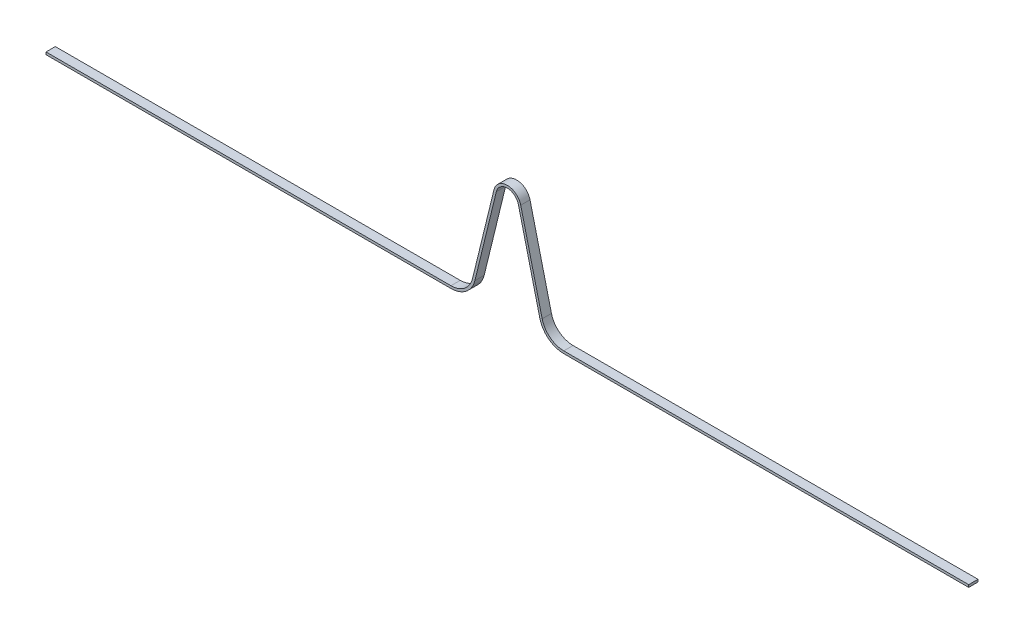
ISO-10303-21;
HEADER;
FILE_DESCRIPTION(('STEP AP214'),'2;1');
FILE_NAME('part.step','',(''),(''),'','','');
FILE_SCHEMA(('AUTOMOTIVE_DESIGN { 1 0 10303 214 1 1 1 1 }'));
ENDSEC;
DATA;
#1=APPLICATION_CONTEXT('core data for automotive mechanical design processes');
#2=APPLICATION_PROTOCOL_DEFINITION('international standard','automotive_design',2000,#1);
#3=PRODUCT_CONTEXT('',#1,'mechanical');
#4=PRODUCT('Part','Part','',(#3));
#5=PRODUCT_RELATED_PRODUCT_CATEGORY('part','',(#4));
#6=PRODUCT_DEFINITION_FORMATION('','',#4);
#7=PRODUCT_DEFINITION_CONTEXT('part definition',#1,'design');
#8=PRODUCT_DEFINITION('design','',#6,#7);
#9=PRODUCT_DEFINITION_SHAPE('','',#8);
#10=(LENGTH_UNIT() NAMED_UNIT(*) SI_UNIT(.MILLI.,.METRE.));
#11=(NAMED_UNIT(*) PLANE_ANGLE_UNIT() SI_UNIT($,.RADIAN.));
#12=(NAMED_UNIT(*) SI_UNIT($,.STERADIAN.) SOLID_ANGLE_UNIT());
#13=UNCERTAINTY_MEASURE_WITH_UNIT(LENGTH_MEASURE(1.E-05),#10,'distance_accuracy_value','');
#14=(GEOMETRIC_REPRESENTATION_CONTEXT(3) GLOBAL_UNCERTAINTY_ASSIGNED_CONTEXT((#13)) GLOBAL_UNIT_ASSIGNED_CONTEXT((#10,
#11,#12)) REPRESENTATION_CONTEXT('',''));
#15=CARTESIAN_POINT('',(0.,0.,0.));
#16=DIRECTION('',(0.,0.,1.));
#17=DIRECTION('',(1.,0.,0.));
#18=AXIS2_PLACEMENT_3D('',#15,#16,#17);
#19=CARTESIAN_POINT('',(248.,-55.8,2.5));
#20=DIRECTION('',(0.,1.,0.));
#21=DIRECTION('',(0.,0.,1.));
#22=AXIS2_PLACEMENT_3D('',#19,#20,#21);
#23=PLANE('',#22);
#24=DIRECTION('',(1.,0.,0.));
#25=VECTOR('',#24,1.);
#26=CARTESIAN_POINT('',(248.,-55.8,-2.5));
#27=LINE('',#26,#25);
#28=CARTESIAN_POINT('',(30.32,-55.8,-2.5));
#29=VERTEX_POINT('',#28);
#30=CARTESIAN_POINT('',(248.,-55.8,-2.5));
#31=VERTEX_POINT('',#30);
#32=EDGE_CURVE('E176',#29,#31,#27,.T.);
#33=ORIENTED_EDGE('',*,*,#32,.T.);
#34=DIRECTION('',(0.,0.,-1.));
#35=VECTOR('',#34,1.);
#36=CARTESIAN_POINT('',(248.,-55.8,2.5));
#37=LINE('',#36,#35);
#38=CARTESIAN_POINT('',(248.,-55.8,2.5));
#39=VERTEX_POINT('',#38);
#40=EDGE_CURVE('E11',#39,#31,#37,.T.);
#41=ORIENTED_EDGE('',*,*,#40,.F.);
#42=DIRECTION('',(1.,0.,0.));
#43=VECTOR('',#42,1.);
#44=CARTESIAN_POINT('',(248.,-55.8,2.5));
#45=LINE('',#44,#43);
#46=CARTESIAN_POINT('',(30.32,-55.8,2.5));
#47=VERTEX_POINT('',#46);
#48=EDGE_CURVE('E113',#47,#39,#45,.T.);
#49=ORIENTED_EDGE('',*,*,#48,.F.);
#50=DIRECTION('',(0.,0.,-1.));
#51=VECTOR('',#50,1.);
#52=CARTESIAN_POINT('',(30.32,-55.8,2.5));
#53=LINE('',#52,#51);
#54=EDGE_CURVE('E172',#47,#29,#53,.T.);
#55=ORIENTED_EDGE('',*,*,#54,.T.);
#56=EDGE_LOOP('',(#33,#41,#49,#55));
#57=FACE_BOUND('',#56,.T.);
#58=ADVANCED_FACE('F33',(#57),#23,.F.);
#59=CARTESIAN_POINT('',(248.,-54.5,2.5));
#60=DIRECTION('',(1.,0.,0.));
#61=DIRECTION('',(0.,0.,-1.));
#62=AXIS2_PLACEMENT_3D('',#59,#60,#61);
#63=PLANE('',#62);
#64=DIRECTION('',(0.,-1.,0.));
#65=VECTOR('',#64,1.);
#66=CARTESIAN_POINT('',(248.,-54.5,-2.5));
#67=LINE('',#66,#65);
#68=CARTESIAN_POINT('',(248.,-54.5,-2.5));
#69=VERTEX_POINT('',#68);
#70=EDGE_CURVE('E179',#69,#31,#67,.T.);
#71=ORIENTED_EDGE('',*,*,#70,.F.);
#72=DIRECTION('',(0.,0.,-1.));
#73=VECTOR('',#72,1.);
#74=CARTESIAN_POINT('',(248.,-54.5,2.5));
#75=LINE('',#74,#73);
#76=CARTESIAN_POINT('',(248.,-54.5,2.5));
#77=VERTEX_POINT('',#76);
#78=EDGE_CURVE('E41',#77,#69,#75,.T.);
#79=ORIENTED_EDGE('',*,*,#78,.F.);
#80=DIRECTION('',(0.,-1.,0.));
#81=VECTOR('',#80,1.);
#82=CARTESIAN_POINT('',(248.,-54.5,2.5));
#83=LINE('',#82,#81);
#84=EDGE_CURVE('E261',#77,#39,#83,.T.);
#85=ORIENTED_EDGE('',*,*,#84,.T.);
#86=ORIENTED_EDGE('',*,*,#40,.T.);
#87=EDGE_LOOP('',(#71,#79,#85,#86));
#88=FACE_BOUND('',#87,.T.);
#89=ADVANCED_FACE('F248',(#88),#63,.T.);
#90=CARTESIAN_POINT('',(248.,-54.5,2.5));
#91=DIRECTION('',(0.,1.,0.));
#92=DIRECTION('',(0.,0.,1.));
#93=AXIS2_PLACEMENT_3D('',#90,#91,#92);
#94=PLANE('',#93);
#95=DIRECTION('',(1.,0.,0.));
#96=VECTOR('',#95,1.);
#97=CARTESIAN_POINT('',(248.,-54.5,-2.5));
#98=LINE('',#97,#96);
#99=CARTESIAN_POINT('',(30.32,-54.5,-2.5));
#100=VERTEX_POINT('',#99);
#101=EDGE_CURVE('E182',#100,#69,#98,.T.);
#102=ORIENTED_EDGE('',*,*,#101,.F.);
#103=DIRECTION('',(0.,0.,-1.));
#104=VECTOR('',#103,1.);
#105=CARTESIAN_POINT('',(30.32,-54.5,2.5));
#106=LINE('',#105,#104);
#107=CARTESIAN_POINT('',(30.32,-54.5,2.5));
#108=VERTEX_POINT('',#107);
#109=EDGE_CURVE('E238',#108,#100,#106,.T.);
#110=ORIENTED_EDGE('',*,*,#109,.F.);
#111=DIRECTION('',(1.,0.,0.));
#112=VECTOR('',#111,1.);
#113=CARTESIAN_POINT('',(248.,-54.5,2.5));
#114=LINE('',#113,#112);
#115=EDGE_CURVE('E245',#108,#77,#114,.T.);
#116=ORIENTED_EDGE('',*,*,#115,.T.);
#117=ORIENTED_EDGE('',*,*,#78,.T.);
#118=EDGE_LOOP('',(#102,#110,#116,#117));
#119=FACE_BOUND('',#118,.T.);
#120=ADVANCED_FACE('F243',(#119),#94,.T.);
#121=CARTESIAN_POINT('',(30.32,-42.55,2.5));
#122=DIRECTION('',(0.,0.,-1.));
#123=DIRECTION('',(-1.,0.,0.));
#124=AXIS2_PLACEMENT_3D('',#121,#122,#123);
#125=CYLINDRICAL_SURFACE('',#124,11.95);
#126=CARTESIAN_POINT('',(30.32,-42.55,-2.5));
#127=DIRECTION('',(0.,0.,1.));
#128=DIRECTION('',(-1.,0.,0.));
#129=AXIS2_PLACEMENT_3D('',#126,#127,#128);
#130=CIRCLE('',#129,11.95);
#131=CARTESIAN_POINT('',(18.7117344497656,-45.3873704226347,-2.5));
#132=VERTEX_POINT('',#131);
#133=EDGE_CURVE('E185',#132,#100,#130,.T.);
#134=ORIENTED_EDGE('',*,*,#133,.F.);
#135=DIRECTION('',(0.,0.,-1.));
#136=VECTOR('',#135,1.);
#137=CARTESIAN_POINT('',(18.7117344497656,-45.3873704226347,2.5));
#138=LINE('',#137,#136);
#139=CARTESIAN_POINT('',(18.7117344497656,-45.3873704226347,2.5));
#140=VERTEX_POINT('',#139);
#141=EDGE_CURVE('E236',#140,#132,#138,.T.);
#142=ORIENTED_EDGE('',*,*,#141,.F.);
#143=CARTESIAN_POINT('',(30.32,-42.55,2.5));
#144=DIRECTION('',(0.,0.,1.));
#145=DIRECTION('',(-1.,0.,0.));
#146=AXIS2_PLACEMENT_3D('',#143,#144,#145);
#147=CIRCLE('',#146,11.95);
#148=EDGE_CURVE('E258',#140,#108,#147,.T.);
#149=ORIENTED_EDGE('',*,*,#148,.T.);
#150=ORIENTED_EDGE('',*,*,#109,.T.);
#151=EDGE_LOOP('',(#134,#142,#149,#150));
#152=FACE_BOUND('',#151,.T.);
#153=ADVANCED_FACE('F255',(#152),#125,.F.);
#154=CARTESIAN_POINT('',(18.7117344497656,-45.3873704226347,2.5));
#155=DIRECTION('',(0.971402974915009,0.237436855450601,0.));
#156=DIRECTION('',(-0.237436855450601,0.971402974915009,0.));
#157=AXIS2_PLACEMENT_3D('',#154,#155,#156);
#158=PLANE('',#157);
#159=DIRECTION('',(0.237436855450601,-0.971402974915009,0.));
#160=VECTOR('',#159,1.);
#161=CARTESIAN_POINT('',(18.7117344497656,-45.3873704226347,-2.5));
#162=LINE('',#161,#160);
#163=CARTESIAN_POINT('',(7.18838201437107,1.75703273033445,-2.5));
#164=VERTEX_POINT('',#163);
#165=EDGE_CURVE('E188',#164,#132,#162,.T.);
#166=ORIENTED_EDGE('',*,*,#165,.F.);
#167=DIRECTION('',(0.,0.,-1.));
#168=VECTOR('',#167,1.);
#169=CARTESIAN_POINT('',(7.18838201437107,1.75703273033445,2.5));
#170=LINE('',#169,#168);
#171=CARTESIAN_POINT('',(7.18838201437107,1.75703273033445,2.5));
#172=VERTEX_POINT('',#171);
#173=EDGE_CURVE('E234',#172,#164,#170,.T.);
#174=ORIENTED_EDGE('',*,*,#173,.F.);
#175=DIRECTION('',(0.237436855450601,-0.971402974915009,0.));
#176=VECTOR('',#175,1.);
#177=CARTESIAN_POINT('',(18.7117344497656,-45.3873704226347,2.5));
#178=LINE('',#177,#176);
#179=EDGE_CURVE('E263',#172,#140,#178,.T.);
#180=ORIENTED_EDGE('',*,*,#179,.T.);
#181=ORIENTED_EDGE('',*,*,#141,.T.);
#182=EDGE_LOOP('',(#166,#174,#180,#181));
#183=FACE_BOUND('',#182,.T.);
#184=ADVANCED_FACE('F320',(#183),#158,.T.);
#185=CARTESIAN_POINT('',(0.,0.,2.5));
#186=DIRECTION('',(0.,0.,-1.));
#187=DIRECTION('',(-1.,0.,0.));
#188=AXIS2_PLACEMENT_3D('',#185,#186,#187);
#189=CYLINDRICAL_SURFACE('',#188,7.4);
#190=CARTESIAN_POINT('',(0.,0.,-2.5));
#191=DIRECTION('',(0.,0.,-1.));
#192=DIRECTION('',(1.,0.,0.));
#193=AXIS2_PLACEMENT_3D('',#190,#191,#192);
#194=CIRCLE('',#193,7.4);
#195=CARTESIAN_POINT('',(-7.18838201437107,1.75703273033445,-2.5));
#196=VERTEX_POINT('',#195);
#197=EDGE_CURVE('E191',#196,#164,#194,.T.);
#198=ORIENTED_EDGE('',*,*,#197,.F.);
#199=DIRECTION('',(0.,0.,-1.));
#200=VECTOR('',#199,1.);
#201=CARTESIAN_POINT('',(-7.18838201437107,1.75703273033445,2.5));
#202=LINE('',#201,#200);
#203=CARTESIAN_POINT('',(-7.18838201437107,1.75703273033445,2.5));
#204=VERTEX_POINT('',#203);
#205=EDGE_CURVE('E232',#204,#196,#202,.T.);
#206=ORIENTED_EDGE('',*,*,#205,.F.);
#207=CARTESIAN_POINT('',(0.,0.,2.5));
#208=DIRECTION('',(0.,0.,-1.));
#209=DIRECTION('',(1.,0.,0.));
#210=AXIS2_PLACEMENT_3D('',#207,#208,#209);
#211=CIRCLE('',#210,7.4);
#212=EDGE_CURVE('E269',#204,#172,#211,.T.);
#213=ORIENTED_EDGE('',*,*,#212,.T.);
#214=ORIENTED_EDGE('',*,*,#173,.T.);
#215=EDGE_LOOP('',(#198,#206,#213,#214));
#216=FACE_BOUND('',#215,.T.);
#217=ADVANCED_FACE('F323',(#216),#189,.T.);
#218=CARTESIAN_POINT('',(-18.7117344497656,-45.3873704226347,2.5));
#219=DIRECTION('',(-0.971402974915009,0.237436855450601,0.));
#220=DIRECTION('',(-0.237436855450601,-0.971402974915009,0.));
#221=AXIS2_PLACEMENT_3D('',#218,#219,#220);
#222=PLANE('',#221);
#223=DIRECTION('',(0.237436855450601,0.971402974915009,0.));
#224=VECTOR('',#223,1.);
#225=CARTESIAN_POINT('',(-18.7117344497656,-45.3873704226347,-2.5));
#226=LINE('',#225,#224);
#227=CARTESIAN_POINT('',(-18.7117344497656,-45.3873704226347,-2.5));
#228=VERTEX_POINT('',#227);
#229=EDGE_CURVE('E194',#228,#196,#226,.T.);
#230=ORIENTED_EDGE('',*,*,#229,.F.);
#231=DIRECTION('',(0.,0.,-1.));
#232=VECTOR('',#231,1.);
#233=CARTESIAN_POINT('',(-18.7117344497656,-45.3873704226347,2.5));
#234=LINE('',#233,#232);
#235=CARTESIAN_POINT('',(-18.7117344497656,-45.3873704226347,2.5));
#236=VERTEX_POINT('',#235);
#237=EDGE_CURVE('E230',#236,#228,#234,.T.);
#238=ORIENTED_EDGE('',*,*,#237,.F.);
#239=DIRECTION('',(0.237436855450601,0.971402974915009,0.));
#240=VECTOR('',#239,1.);
#241=CARTESIAN_POINT('',(-18.7117344497656,-45.3873704226347,2.5));
#242=LINE('',#241,#240);
#243=EDGE_CURVE('E272',#236,#204,#242,.T.);
#244=ORIENTED_EDGE('',*,*,#243,.T.);
#245=ORIENTED_EDGE('',*,*,#205,.T.);
#246=EDGE_LOOP('',(#230,#238,#244,#245));
#247=FACE_BOUND('',#246,.T.);
#248=ADVANCED_FACE('F327',(#247),#222,.T.);
#249=CARTESIAN_POINT('',(-30.32,-42.55,2.5));
#250=DIRECTION('',(0.,0.,-1.));
#251=DIRECTION('',(-1.,0.,0.));
#252=AXIS2_PLACEMENT_3D('',#249,#250,#251);
#253=CYLINDRICAL_SURFACE('',#252,11.95);
#254=CARTESIAN_POINT('',(-30.32,-42.55,-2.5));
#255=DIRECTION('',(0.,0.,1.));
#256=DIRECTION('',(1.,0.,0.));
#257=AXIS2_PLACEMENT_3D('',#254,#255,#256);
#258=CIRCLE('',#257,11.95);
#259=CARTESIAN_POINT('',(-30.32,-54.5,-2.5));
#260=VERTEX_POINT('',#259);
#261=EDGE_CURVE('E197',#260,#228,#258,.T.);
#262=ORIENTED_EDGE('',*,*,#261,.F.);
#263=DIRECTION('',(0.,0.,-1.));
#264=VECTOR('',#263,1.);
#265=CARTESIAN_POINT('',(-30.32,-54.5,2.5));
#266=LINE('',#265,#264);
#267=CARTESIAN_POINT('',(-30.32,-54.5,2.5));
#268=VERTEX_POINT('',#267);
#269=EDGE_CURVE('E228',#268,#260,#266,.T.);
#270=ORIENTED_EDGE('',*,*,#269,.F.);
#271=CARTESIAN_POINT('',(-30.32,-42.55,2.5));
#272=DIRECTION('',(0.,0.,1.));
#273=DIRECTION('',(1.,0.,0.));
#274=AXIS2_PLACEMENT_3D('',#271,#272,#273);
#275=CIRCLE('',#274,11.95);
#276=EDGE_CURVE('E275',#268,#236,#275,.T.);
#277=ORIENTED_EDGE('',*,*,#276,.T.);
#278=ORIENTED_EDGE('',*,*,#237,.T.);
#279=EDGE_LOOP('',(#262,#270,#277,#278));
#280=FACE_BOUND('',#279,.T.);
#281=ADVANCED_FACE('F331',(#280),#253,.F.);
#282=CARTESIAN_POINT('',(-248.,-54.5,2.5));
#283=DIRECTION('',(0.,1.,0.));
#284=DIRECTION('',(-1.,0.,0.));
#285=AXIS2_PLACEMENT_3D('',#282,#283,#284);
#286=PLANE('',#285);
#287=DIRECTION('',(1.,0.,0.));
#288=VECTOR('',#287,1.);
#289=CARTESIAN_POINT('',(-248.,-54.5,-2.5));
#290=LINE('',#289,#288);
#291=CARTESIAN_POINT('',(-248.,-54.5,-2.5));
#292=VERTEX_POINT('',#291);
#293=EDGE_CURVE('E200',#292,#260,#290,.T.);
#294=ORIENTED_EDGE('',*,*,#293,.F.);
#295=DIRECTION('',(0.,0.,-1.));
#296=VECTOR('',#295,1.);
#297=CARTESIAN_POINT('',(-248.,-54.5,2.5));
#298=LINE('',#297,#296);
#299=CARTESIAN_POINT('',(-248.,-54.5,2.5));
#300=VERTEX_POINT('',#299);
#301=EDGE_CURVE('E226',#300,#292,#298,.T.);
#302=ORIENTED_EDGE('',*,*,#301,.F.);
#303=DIRECTION('',(1.,0.,0.));
#304=VECTOR('',#303,1.);
#305=CARTESIAN_POINT('',(-248.,-54.5,2.5));
#306=LINE('',#305,#304);
#307=EDGE_CURVE('E278',#300,#268,#306,.T.);
#308=ORIENTED_EDGE('',*,*,#307,.T.);
#309=ORIENTED_EDGE('',*,*,#269,.T.);
#310=EDGE_LOOP('',(#294,#302,#308,#309));
#311=FACE_BOUND('',#310,.T.);
#312=ADVANCED_FACE('F335',(#311),#286,.T.);
#313=CARTESIAN_POINT('',(-248.,-55.8,2.5));
#314=DIRECTION('',(-1.,0.,0.));
#315=DIRECTION('',(0.,0.,1.));
#316=AXIS2_PLACEMENT_3D('',#313,#314,#315);
#317=PLANE('',#316);
#318=DIRECTION('',(0.,1.,0.));
#319=VECTOR('',#318,1.);
#320=CARTESIAN_POINT('',(-248.,-55.8,-2.5));
#321=LINE('',#320,#319);
#322=CARTESIAN_POINT('',(-248.,-55.8,-2.5));
#323=VERTEX_POINT('',#322);
#324=EDGE_CURVE('E203',#323,#292,#321,.T.);
#325=ORIENTED_EDGE('',*,*,#324,.F.);
#326=DIRECTION('',(0.,0.,-1.));
#327=VECTOR('',#326,1.);
#328=CARTESIAN_POINT('',(-248.,-55.8,2.5));
#329=LINE('',#328,#327);
#330=CARTESIAN_POINT('',(-248.,-55.8,2.5));
#331=VERTEX_POINT('',#330);
#332=EDGE_CURVE('E224',#331,#323,#329,.T.);
#333=ORIENTED_EDGE('',*,*,#332,.F.);
#334=DIRECTION('',(0.,1.,0.));
#335=VECTOR('',#334,1.);
#336=CARTESIAN_POINT('',(-248.,-55.8,2.5));
#337=LINE('',#336,#335);
#338=EDGE_CURVE('E281',#331,#300,#337,.T.);
#339=ORIENTED_EDGE('',*,*,#338,.T.);
#340=ORIENTED_EDGE('',*,*,#301,.T.);
#341=EDGE_LOOP('',(#325,#333,#339,#340));
#342=FACE_BOUND('',#341,.T.);
#343=ADVANCED_FACE('F339',(#342),#317,.T.);
#344=CARTESIAN_POINT('',(-248.,-55.8,2.5));
#345=DIRECTION('',(0.,1.,0.));
#346=DIRECTION('',(-1.,0.,0.));
#347=AXIS2_PLACEMENT_3D('',#344,#345,#346);
#348=PLANE('',#347);
#349=DIRECTION('',(1.,0.,0.));
#350=VECTOR('',#349,1.);
#351=CARTESIAN_POINT('',(-248.,-55.8,-2.5));
#352=LINE('',#351,#350);
#353=CARTESIAN_POINT('',(-30.32,-55.8,-2.5));
#354=VERTEX_POINT('',#353);
#355=EDGE_CURVE('E206',#323,#354,#352,.T.);
#356=ORIENTED_EDGE('',*,*,#355,.T.);
#357=DIRECTION('',(0.,0.,-1.));
#358=VECTOR('',#357,1.);
#359=CARTESIAN_POINT('',(-30.32,-55.8,2.5));
#360=LINE('',#359,#358);
#361=CARTESIAN_POINT('',(-30.32,-55.8,2.5));
#362=VERTEX_POINT('',#361);
#363=EDGE_CURVE('E221',#362,#354,#360,.T.);
#364=ORIENTED_EDGE('',*,*,#363,.F.);
#365=DIRECTION('',(1.,0.,0.));
#366=VECTOR('',#365,1.);
#367=CARTESIAN_POINT('',(-248.,-55.8,2.5));
#368=LINE('',#367,#366);
#369=EDGE_CURVE('E284',#331,#362,#368,.T.);
#370=ORIENTED_EDGE('',*,*,#369,.F.);
#371=ORIENTED_EDGE('',*,*,#332,.T.);
#372=EDGE_LOOP('',(#356,#364,#370,#371));
#373=FACE_BOUND('',#372,.T.);
#374=ADVANCED_FACE('F343',(#373),#348,.F.);
#375=CARTESIAN_POINT('',(-30.32,-42.55,2.5));
#376=DIRECTION('',(0.,0.,-1.));
#377=DIRECTION('',(-1.,0.,0.));
#378=AXIS2_PLACEMENT_3D('',#375,#376,#377);
#379=CYLINDRICAL_SURFACE('',#378,13.25);
#380=CARTESIAN_POINT('',(-30.32,-42.55,-2.5));
#381=DIRECTION('',(0.,0.,1.));
#382=DIRECTION('',(1.,0.,0.));
#383=AXIS2_PLACEMENT_3D('',#380,#381,#382);
#384=CIRCLE('',#383,13.25);
#385=CARTESIAN_POINT('',(-17.4489105823761,-45.6960383347205,-2.5));
#386=VERTEX_POINT('',#385);
#387=EDGE_CURVE('E208',#354,#386,#384,.T.);
#388=ORIENTED_EDGE('',*,*,#387,.T.);
#389=DIRECTION('',(0.,0.,-1.));
#390=VECTOR('',#389,1.);
#391=CARTESIAN_POINT('',(-17.4489105823761,-45.6960383347205,2.5));
#392=LINE('',#391,#390);
#393=CARTESIAN_POINT('',(-17.4489105823761,-45.6960383347205,2.5));
#394=VERTEX_POINT('',#393);
#395=EDGE_CURVE('E218',#394,#386,#392,.T.);
#396=ORIENTED_EDGE('',*,*,#395,.F.);
#397=CARTESIAN_POINT('',(-30.32,-42.55,2.5));
#398=DIRECTION('',(0.,0.,1.));
#399=DIRECTION('',(1.,0.,0.));
#400=AXIS2_PLACEMENT_3D('',#397,#398,#399);
#401=CIRCLE('',#400,13.25);
#402=EDGE_CURVE('E286',#362,#394,#401,.T.);
#403=ORIENTED_EDGE('',*,*,#402,.F.);
#404=ORIENTED_EDGE('',*,*,#363,.T.);
#405=EDGE_LOOP('',(#388,#396,#403,#404));
#406=FACE_BOUND('',#405,.T.);
#407=ADVANCED_FACE('F293',(#406),#379,.T.);
#408=CARTESIAN_POINT('',(-17.4489105823761,-45.6960383347205,2.5));
#409=DIRECTION('',(-0.971402974915009,0.237436855450601,0.));
#410=DIRECTION('',(-0.237436855450601,-0.971402974915009,0.));
#411=AXIS2_PLACEMENT_3D('',#408,#409,#410);
#412=PLANE('',#411);
#413=DIRECTION('',(0.237436855450601,0.971402974915009,0.));
#414=VECTOR('',#413,1.);
#415=CARTESIAN_POINT('',(-17.4489105823761,-45.6960383347205,-2.5));
#416=LINE('',#415,#414);
#417=CARTESIAN_POINT('',(-5.92555814698156,1.44836481824867,-2.5));
#418=VERTEX_POINT('',#417);
#419=EDGE_CURVE('E210',#386,#418,#416,.T.);
#420=ORIENTED_EDGE('',*,*,#419,.T.);
#421=DIRECTION('',(0.,0.,-1.));
#422=VECTOR('',#421,1.);
#423=CARTESIAN_POINT('',(-5.92555814698156,1.44836481824867,2.5));
#424=LINE('',#423,#422);
#425=CARTESIAN_POINT('',(-5.92555814698156,1.44836481824867,2.5));
#426=VERTEX_POINT('',#425);
#427=EDGE_CURVE('E167',#426,#418,#424,.T.);
#428=ORIENTED_EDGE('',*,*,#427,.F.);
#429=DIRECTION('',(0.237436855450601,0.971402974915009,0.));
#430=VECTOR('',#429,1.);
#431=CARTESIAN_POINT('',(-17.4489105823761,-45.6960383347205,2.5));
#432=LINE('',#431,#430);
#433=EDGE_CURVE('E158',#394,#426,#432,.T.);
#434=ORIENTED_EDGE('',*,*,#433,.F.);
#435=ORIENTED_EDGE('',*,*,#395,.T.);
#436=EDGE_LOOP('',(#420,#428,#434,#435));
#437=FACE_BOUND('',#436,.T.);
#438=ADVANCED_FACE('F297',(#437),#412,.F.);
#439=CARTESIAN_POINT('',(0.,0.,2.5));
#440=DIRECTION('',(0.,0.,-1.));
#441=DIRECTION('',(-1.,0.,0.));
#442=AXIS2_PLACEMENT_3D('',#439,#440,#441);
#443=CYLINDRICAL_SURFACE('',#442,6.1);
#444=CARTESIAN_POINT('',(0.,0.,-2.5));
#445=DIRECTION('',(0.,0.,1.));
#446=DIRECTION('',(1.,0.,0.));
#447=AXIS2_PLACEMENT_3D('',#444,#445,#446);
#448=CIRCLE('',#447,6.1);
#449=CARTESIAN_POINT('',(5.92555814698156,1.44836481824868,-2.5));
#450=VERTEX_POINT('',#449);
#451=EDGE_CURVE('E166',#418,#450,#448,.F.);
#452=ORIENTED_EDGE('',*,*,#451,.T.);
#453=DIRECTION('',(0.,0.,-1.));
#454=VECTOR('',#453,1.);
#455=CARTESIAN_POINT('',(5.92555814698156,1.44836481824868,2.5));
#456=LINE('',#455,#454);
#457=CARTESIAN_POINT('',(5.92555814698156,1.44836481824868,2.5));
#458=VERTEX_POINT('',#457);
#459=EDGE_CURVE('E163',#458,#450,#456,.T.);
#460=ORIENTED_EDGE('',*,*,#459,.F.);
#461=CARTESIAN_POINT('',(0.,0.,2.5));
#462=DIRECTION('',(0.,0.,1.));
#463=DIRECTION('',(1.,0.,0.));
#464=AXIS2_PLACEMENT_3D('',#461,#462,#463);
#465=CIRCLE('',#464,6.1);
#466=EDGE_CURVE('E152',#426,#458,#465,.F.);
#467=ORIENTED_EDGE('',*,*,#466,.F.);
#468=ORIENTED_EDGE('',*,*,#427,.T.);
#469=EDGE_LOOP('',(#452,#460,#467,#468));
#470=FACE_BOUND('',#469,.T.);
#471=ADVANCED_FACE('F164',(#470),#443,.F.);
#472=CARTESIAN_POINT('',(17.4489105823761,-45.6960383347205,2.5));
#473=DIRECTION('',(0.971402974915009,0.237436855450601,0.));
#474=DIRECTION('',(-0.237436855450601,0.971402974915009,0.));
#475=AXIS2_PLACEMENT_3D('',#472,#473,#474);
#476=PLANE('',#475);
#477=DIRECTION('',(0.237436855450601,-0.971402974915009,0.));
#478=VECTOR('',#477,1.);
#479=CARTESIAN_POINT('',(17.4489105823761,-45.6960383347205,-2.5));
#480=LINE('',#479,#478);
#481=CARTESIAN_POINT('',(17.4489105823761,-45.6960383347205,-2.5));
#482=VERTEX_POINT('',#481);
#483=EDGE_CURVE('E101',#450,#482,#480,.T.);
#484=ORIENTED_EDGE('',*,*,#483,.T.);
#485=DIRECTION('',(0.,0.,-1.));
#486=VECTOR('',#485,1.);
#487=CARTESIAN_POINT('',(17.4489105823761,-45.6960383347205,2.5));
#488=LINE('',#487,#486);
#489=CARTESIAN_POINT('',(17.4489105823761,-45.6960383347205,2.5));
#490=VERTEX_POINT('',#489);
#491=EDGE_CURVE('E168',#490,#482,#488,.T.);
#492=ORIENTED_EDGE('',*,*,#491,.F.);
#493=DIRECTION('',(0.237436855450601,-0.971402974915009,0.));
#494=VECTOR('',#493,1.);
#495=CARTESIAN_POINT('',(17.4489105823761,-45.6960383347205,2.5));
#496=LINE('',#495,#494);
#497=EDGE_CURVE('E156',#458,#490,#496,.T.);
#498=ORIENTED_EDGE('',*,*,#497,.F.);
#499=ORIENTED_EDGE('',*,*,#459,.T.);
#500=EDGE_LOOP('',(#484,#492,#498,#499));
#501=FACE_BOUND('',#500,.T.);
#502=ADVANCED_FACE('F170',(#501),#476,.F.);
#503=CARTESIAN_POINT('',(30.32,-42.55,2.5));
#504=DIRECTION('',(0.,0.,-1.));
#505=DIRECTION('',(-1.,0.,0.));
#506=AXIS2_PLACEMENT_3D('',#503,#504,#505);
#507=CYLINDRICAL_SURFACE('',#506,13.25);
#508=CARTESIAN_POINT('',(30.32,-42.55,-2.5));
#509=DIRECTION('',(0.,0.,1.));
#510=DIRECTION('',(1.,0.,0.));
#511=AXIS2_PLACEMENT_3D('',#508,#509,#510);
#512=CIRCLE('',#511,13.25);
#513=EDGE_CURVE('E107',#482,#29,#512,.T.);
#514=ORIENTED_EDGE('',*,*,#513,.T.);
#515=ORIENTED_EDGE('',*,*,#54,.F.);
#516=CARTESIAN_POINT('',(30.32,-42.55,2.5));
#517=DIRECTION('',(0.,0.,1.));
#518=DIRECTION('',(1.,0.,0.));
#519=AXIS2_PLACEMENT_3D('',#516,#517,#518);
#520=CIRCLE('',#519,13.25);
#521=EDGE_CURVE('E49',#490,#47,#520,.T.);
#522=ORIENTED_EDGE('',*,*,#521,.F.);
#523=ORIENTED_EDGE('',*,*,#491,.T.);
#524=EDGE_LOOP('',(#514,#515,#522,#523));
#525=FACE_BOUND('',#524,.T.);
#526=ADVANCED_FACE('F299',(#525),#507,.T.);
#527=CARTESIAN_POINT('',(30.32,-42.55,2.5));
#528=DIRECTION('',(0.,0.,1.));
#529=DIRECTION('',(1.,0.,0.));
#530=AXIS2_PLACEMENT_3D('',#527,#528,#529);
#531=PLANE('',#530);
#532=ORIENTED_EDGE('',*,*,#48,.T.);
#533=ORIENTED_EDGE('',*,*,#84,.F.);
#534=ORIENTED_EDGE('',*,*,#115,.F.);
#535=ORIENTED_EDGE('',*,*,#148,.F.);
#536=ORIENTED_EDGE('',*,*,#179,.F.);
#537=ORIENTED_EDGE('',*,*,#212,.F.);
#538=ORIENTED_EDGE('',*,*,#243,.F.);
#539=ORIENTED_EDGE('',*,*,#276,.F.);
#540=ORIENTED_EDGE('',*,*,#307,.F.);
#541=ORIENTED_EDGE('',*,*,#338,.F.);
#542=ORIENTED_EDGE('',*,*,#369,.T.);
#543=ORIENTED_EDGE('',*,*,#402,.T.);
#544=ORIENTED_EDGE('',*,*,#433,.T.);
#545=ORIENTED_EDGE('',*,*,#466,.T.);
#546=ORIENTED_EDGE('',*,*,#497,.T.);
#547=ORIENTED_EDGE('',*,*,#521,.T.);
#548=EDGE_LOOP('',(#532,#533,#534,#535,#536,#537,#538,#539,#540,#541,#542,#543,#544,#545,#546,#547));
#549=FACE_BOUND('',#548,.T.);
#550=ADVANCED_FACE('F154',(#549),#531,.T.);
#551=CARTESIAN_POINT('',(30.32,-42.55,-2.5));
#552=DIRECTION('',(0.,0.,1.));
#553=DIRECTION('',(1.,0.,0.));
#554=AXIS2_PLACEMENT_3D('',#551,#552,#553);
#555=PLANE('',#554);
#556=ORIENTED_EDGE('',*,*,#32,.F.);
#557=ORIENTED_EDGE('',*,*,#513,.F.);
#558=ORIENTED_EDGE('',*,*,#483,.F.);
#559=ORIENTED_EDGE('',*,*,#451,.F.);
#560=ORIENTED_EDGE('',*,*,#419,.F.);
#561=ORIENTED_EDGE('',*,*,#387,.F.);
#562=ORIENTED_EDGE('',*,*,#355,.F.);
#563=ORIENTED_EDGE('',*,*,#324,.T.);
#564=ORIENTED_EDGE('',*,*,#293,.T.);
#565=ORIENTED_EDGE('',*,*,#261,.T.);
#566=ORIENTED_EDGE('',*,*,#229,.T.);
#567=ORIENTED_EDGE('',*,*,#197,.T.);
#568=ORIENTED_EDGE('',*,*,#165,.T.);
#569=ORIENTED_EDGE('',*,*,#133,.T.);
#570=ORIENTED_EDGE('',*,*,#101,.T.);
#571=ORIENTED_EDGE('',*,*,#70,.T.);
#572=EDGE_LOOP('',(#556,#557,#558,#559,#560,#561,#562,#563,#564,#565,#566,#567,#568,#569,#570,#571));
#573=FACE_BOUND('',#572,.T.);
#574=ADVANCED_FACE('F251',(#573),#555,.F.);
#575=CLOSED_SHELL('',(#58,#89,#120,#153,#184,#217,#248,#281,#312,#343,#374,#407,#438,#471,#502,
#526,#550,#574));
#576=MANIFOLD_SOLID_BREP('B2',#575);
#577=ADVANCED_BREP_SHAPE_REPRESENTATION('',(#18,#576),#14);
#578=SHAPE_DEFINITION_REPRESENTATION(#9,#577);
ENDSEC;
END-ISO-10303-21;
